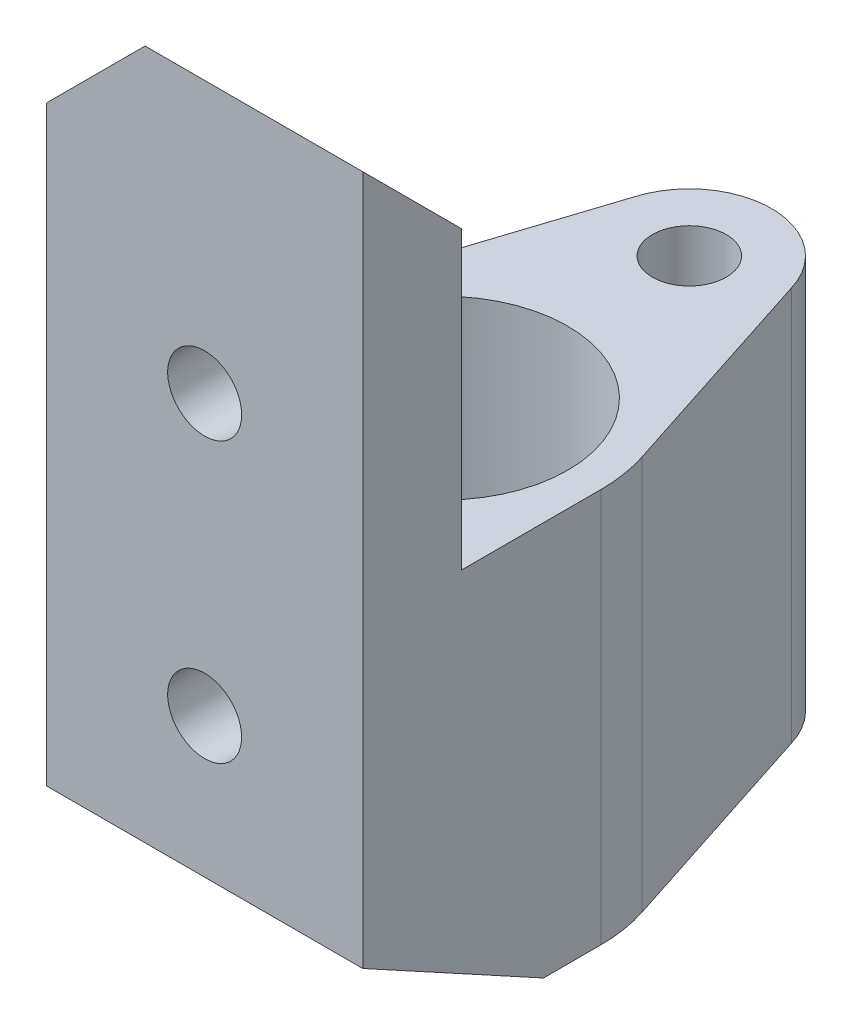
ISO-10303-21;
HEADER;
FILE_DESCRIPTION(('STEP AP214'),'2;1');
FILE_NAME('part.step','',(''),(''),'','','');
FILE_SCHEMA(('AUTOMOTIVE_DESIGN { 1 0 10303 214 1 1 1 1 }'));
ENDSEC;
DATA;
#1=APPLICATION_CONTEXT('core data for automotive mechanical design processes');
#2=APPLICATION_PROTOCOL_DEFINITION('international standard','automotive_design',2000,#1);
#3=PRODUCT_CONTEXT('',#1,'mechanical');
#4=PRODUCT('Part','Part','',(#3));
#5=PRODUCT_RELATED_PRODUCT_CATEGORY('part','',(#4));
#6=PRODUCT_DEFINITION_FORMATION('','',#4);
#7=PRODUCT_DEFINITION_CONTEXT('part definition',#1,'design');
#8=PRODUCT_DEFINITION('design','',#6,#7);
#9=PRODUCT_DEFINITION_SHAPE('','',#8);
#10=(LENGTH_UNIT() NAMED_UNIT(*) SI_UNIT(.MILLI.,.METRE.));
#11=(NAMED_UNIT(*) PLANE_ANGLE_UNIT() SI_UNIT($,.RADIAN.));
#12=(NAMED_UNIT(*) SI_UNIT($,.STERADIAN.) SOLID_ANGLE_UNIT());
#13=UNCERTAINTY_MEASURE_WITH_UNIT(LENGTH_MEASURE(1.E-05),#10,'distance_accuracy_value','');
#14=(GEOMETRIC_REPRESENTATION_CONTEXT(3) GLOBAL_UNCERTAINTY_ASSIGNED_CONTEXT((#13)) GLOBAL_UNIT_ASSIGNED_CONTEXT((#10,
#11,#12)) REPRESENTATION_CONTEXT('',''));
#15=CARTESIAN_POINT('',(0.,0.,0.));
#16=DIRECTION('',(0.,0.,1.));
#17=DIRECTION('',(1.,0.,0.));
#18=AXIS2_PLACEMENT_3D('',#15,#16,#17);
#19=CARTESIAN_POINT('',(1.76941794549634E-13,24.,0.));
#20=DIRECTION('',(0.,-1.,0.));
#21=DIRECTION('',(0.,0.,-1.));
#22=AXIS2_PLACEMENT_3D('',#19,#20,#21);
#23=PLANE('',#22);
#24=DIRECTION('',(0.,0.,-1.));
#25=VECTOR('',#24,1.);
#26=CARTESIAN_POINT('',(9.62500000000001,24.,8.5));
#27=LINE('',#26,#25);
#28=CARTESIAN_POINT('',(9.62500000000001,24.,8.5));
#29=VERTEX_POINT('',#28);
#30=CARTESIAN_POINT('',(9.62500000000001,24.,0.));
#31=VERTEX_POINT('',#30);
#32=EDGE_CURVE('E152',#29,#31,#27,.T.);
#33=ORIENTED_EDGE('',*,*,#32,.T.);
#34=CARTESIAN_POINT('',(1.76941794549634E-13,24.,0.));
#35=DIRECTION('',(0.,1.,0.));
#36=DIRECTION('',(0.,0.,-1.));
#37=AXIS2_PLACEMENT_3D('',#34,#35,#36);
#38=CIRCLE('',#37,9.62499999999983);
#39=CARTESIAN_POINT('',(9.15566286321893,24.,-2.96891605389473));
#40=VERTEX_POINT('',#39);
#41=EDGE_CURVE('E156',#31,#40,#38,.T.);
#42=ORIENTED_EDGE('',*,*,#41,.T.);
#43=DIRECTION('',(-0.308458810794258,0.,-0.951237700074693));
#44=VECTOR('',#43,1.);
#45=CARTESIAN_POINT('',(4.79671218659505,24.,-16.4112236530652));
#46=LINE('',#45,#44);
#47=CARTESIAN_POINT('',(4.79671218659505,24.,-16.4112236530652));
#48=VERTEX_POINT('',#47);
#49=EDGE_CURVE('E226',#40,#48,#46,.T.);
#50=ORIENTED_EDGE('',*,*,#49,.T.);
#51=CARTESIAN_POINT('',(0.,24.,-15.));
#52=DIRECTION('',(0.,1.,0.));
#53=DIRECTION('',(0.,0.,-1.));
#54=AXIS2_PLACEMENT_3D('',#51,#52,#53);
#55=CIRCLE('',#54,5.);
#56=CARTESIAN_POINT('',(-4.79671218659505,24.,-16.4112236530652));
#57=VERTEX_POINT('',#56);
#58=EDGE_CURVE('E228',#48,#57,#55,.T.);
#59=ORIENTED_EDGE('',*,*,#58,.T.);
#60=DIRECTION('',(-0.308458810794258,0.,0.951237700074693));
#61=VECTOR('',#60,1.);
#62=CARTESIAN_POINT('',(-4.79671218659505,24.,-16.4112236530652));
#63=LINE('',#62,#61);
#64=CARTESIAN_POINT('',(-9.15566286321892,24.,-2.96891605389473));
#65=VERTEX_POINT('',#64);
#66=EDGE_CURVE('E230',#57,#65,#63,.T.);
#67=ORIENTED_EDGE('',*,*,#66,.T.);
#68=CARTESIAN_POINT('',(1.76941794549634E-13,24.,0.));
#69=DIRECTION('',(0.,1.,0.));
#70=DIRECTION('',(0.,0.,1.));
#71=AXIS2_PLACEMENT_3D('',#68,#69,#70);
#72=CIRCLE('',#71,9.62500000000018);
#73=CARTESIAN_POINT('',(-9.625,24.,0.));
#74=VERTEX_POINT('',#73);
#75=EDGE_CURVE('E232',#65,#74,#72,.T.);
#76=ORIENTED_EDGE('',*,*,#75,.T.);
#77=DIRECTION('',(0.,0.,1.));
#78=VECTOR('',#77,1.);
#79=CARTESIAN_POINT('',(-9.625,24.,8.5));
#80=LINE('',#79,#78);
#81=CARTESIAN_POINT('',(-9.625,24.,8.5));
#82=VERTEX_POINT('',#81);
#83=EDGE_CURVE('E234',#74,#82,#80,.T.);
#84=ORIENTED_EDGE('',*,*,#83,.T.);
#85=DIRECTION('',(1.,0.,0.));
#86=VECTOR('',#85,1.);
#87=CARTESIAN_POINT('',(-9.625,24.,8.5));
#88=LINE('',#87,#86);
#89=EDGE_CURVE('E164',#82,#29,#88,.T.);
#90=ORIENTED_EDGE('',*,*,#89,.T.);
#91=EDGE_LOOP('',(#33,#42,#50,#59,#67,#76,#84,#90));
#92=FACE_BOUND('',#91,.T.);
#93=CARTESIAN_POINT('',(0.,24.,0.));
#94=DIRECTION('',(0.,1.,0.));
#95=DIRECTION('',(0.,0.,1.));
#96=AXIS2_PLACEMENT_3D('',#93,#94,#95);
#97=CIRCLE('',#96,7.6);
#98=CARTESIAN_POINT('',(0.,24.,7.6));
#99=VERTEX_POINT('',#98);
#100=EDGE_CURVE('E220',#99,#99,#97,.T.);
#101=ORIENTED_EDGE('',*,*,#100,.F.);
#102=EDGE_LOOP('',(#101));
#103=FACE_BOUND('',#102,.T.);
#104=CARTESIAN_POINT('',(0.,24.,-15.));
#105=DIRECTION('',(0.,1.,0.));
#106=DIRECTION('',(0.,0.,1.));
#107=AXIS2_PLACEMENT_3D('',#104,#105,#106);
#108=CIRCLE('',#107,2.25);
#109=CARTESIAN_POINT('',(0.,24.,-12.75));
#110=VERTEX_POINT('',#109);
#111=EDGE_CURVE('E215',#110,#110,#108,.T.);
#112=ORIENTED_EDGE('',*,*,#111,.F.);
#113=EDGE_LOOP('',(#112));
#114=FACE_BOUND('',#113,.T.);
#115=ADVANCED_FACE('F32',(#92,#103,#114),#23,.F.);
#116=CARTESIAN_POINT('',(1.76941794549634E-13,0.,0.));
#117=DIRECTION('',(0.,-1.,0.));
#118=DIRECTION('',(0.,0.,-1.));
#119=AXIS2_PLACEMENT_3D('',#116,#117,#118);
#120=PLANE('',#119);
#121=DIRECTION('',(1.,0.,0.));
#122=VECTOR('',#121,1.);
#123=CARTESIAN_POINT('',(-9.625,0.,3.50000000000002));
#124=LINE('',#123,#122);
#125=CARTESIAN_POINT('',(-9.625,0.,3.50000000000002));
#126=VERTEX_POINT('',#125);
#127=CARTESIAN_POINT('',(-6.74610999020916,0.,3.50000000000002));
#128=VERTEX_POINT('',#127);
#129=EDGE_CURVE('E125',#126,#128,#124,.T.);
#130=ORIENTED_EDGE('',*,*,#129,.F.);
#131=DIRECTION('',(0.,0.,1.));
#132=VECTOR('',#131,1.);
#133=CARTESIAN_POINT('',(-9.625,0.,8.5));
#134=LINE('',#133,#132);
#135=CARTESIAN_POINT('',(-9.625,0.,0.));
#136=VERTEX_POINT('',#135);
#137=EDGE_CURVE('E142',#136,#126,#134,.T.);
#138=ORIENTED_EDGE('',*,*,#137,.F.);
#139=CARTESIAN_POINT('',(1.76941794549634E-13,0.,0.));
#140=DIRECTION('',(0.,1.,0.));
#141=DIRECTION('',(0.,0.,1.));
#142=AXIS2_PLACEMENT_3D('',#139,#140,#141);
#143=CIRCLE('',#142,9.62500000000018);
#144=CARTESIAN_POINT('',(-9.15566286321892,0.,-2.96891605389473));
#145=VERTEX_POINT('',#144);
#146=EDGE_CURVE('E153',#145,#136,#143,.T.);
#147=ORIENTED_EDGE('',*,*,#146,.F.);
#148=DIRECTION('',(-0.308458810794258,0.,0.951237700074693));
#149=VECTOR('',#148,1.);
#150=CARTESIAN_POINT('',(-4.79671218659505,0.,-16.4112236530652));
#151=LINE('',#150,#149);
#152=CARTESIAN_POINT('',(-4.79671218659505,0.,-16.4112236530652));
#153=VERTEX_POINT('',#152);
#154=EDGE_CURVE('E158',#153,#145,#151,.T.);
#155=ORIENTED_EDGE('',*,*,#154,.F.);
#156=CARTESIAN_POINT('',(0.,0.,-15.));
#157=DIRECTION('',(0.,1.,0.));
#158=DIRECTION('',(0.,0.,-1.));
#159=AXIS2_PLACEMENT_3D('',#156,#157,#158);
#160=CIRCLE('',#159,5.);
#161=CARTESIAN_POINT('',(4.79671218659505,0.,-16.4112236530652));
#162=VERTEX_POINT('',#161);
#163=EDGE_CURVE('E242',#162,#153,#160,.T.);
#164=ORIENTED_EDGE('',*,*,#163,.F.);
#165=DIRECTION('',(-0.308458810794258,0.,-0.951237700074693));
#166=VECTOR('',#165,1.);
#167=CARTESIAN_POINT('',(4.79671218659505,0.,-16.4112236530652));
#168=LINE('',#167,#166);
#169=CARTESIAN_POINT('',(9.15566286321893,0.,-2.96891605389473));
#170=VERTEX_POINT('',#169);
#171=EDGE_CURVE('E240',#170,#162,#168,.T.);
#172=ORIENTED_EDGE('',*,*,#171,.F.);
#173=CARTESIAN_POINT('',(1.76941794549634E-13,0.,0.));
#174=DIRECTION('',(0.,1.,0.));
#175=DIRECTION('',(0.,0.,-1.));
#176=AXIS2_PLACEMENT_3D('',#173,#174,#175);
#177=CIRCLE('',#176,9.62499999999983);
#178=CARTESIAN_POINT('',(9.62500000000001,0.,0.));
#179=VERTEX_POINT('',#178);
#180=EDGE_CURVE('E238',#179,#170,#177,.T.);
#181=ORIENTED_EDGE('',*,*,#180,.F.);
#182=DIRECTION('',(0.,0.,-1.));
#183=VECTOR('',#182,1.);
#184=CARTESIAN_POINT('',(9.62500000000001,0.,8.5));
#185=LINE('',#184,#183);
#186=CARTESIAN_POINT('',(9.62500000000001,0.,3.50000000000002));
#187=VERTEX_POINT('',#186);
#188=EDGE_CURVE('E223',#187,#179,#185,.T.);
#189=ORIENTED_EDGE('',*,*,#188,.F.);
#190=CARTESIAN_POINT('',(6.74610999020916,0.,3.50000000000002));
#191=VERTEX_POINT('',#190);
#192=EDGE_CURVE('E133',#191,#187,#124,.T.);
#193=ORIENTED_EDGE('',*,*,#192,.F.);
#194=CARTESIAN_POINT('',(0.,0.,0.));
#195=DIRECTION('',(0.,1.,0.));
#196=DIRECTION('',(0.,0.,1.));
#197=AXIS2_PLACEMENT_3D('',#194,#195,#196);
#198=CIRCLE('',#197,7.6);
#199=EDGE_CURVE('E145',#191,#128,#198,.T.);
#200=ORIENTED_EDGE('',*,*,#199,.T.);
#201=EDGE_LOOP('',(#130,#138,#147,#155,#164,#172,#181,#189,#193,#200));
#202=FACE_BOUND('',#201,.T.);
#203=CARTESIAN_POINT('',(0.,0.,-15.));
#204=DIRECTION('',(0.,1.,0.));
#205=DIRECTION('',(0.,0.,1.));
#206=AXIS2_PLACEMENT_3D('',#203,#204,#205);
#207=CIRCLE('',#206,2.25);
#208=CARTESIAN_POINT('',(0.,0.,-12.75));
#209=VERTEX_POINT('',#208);
#210=EDGE_CURVE('E208',#209,#209,#207,.T.);
#211=ORIENTED_EDGE('',*,*,#210,.T.);
#212=EDGE_LOOP('',(#211));
#213=FACE_BOUND('',#212,.T.);
#214=ADVANCED_FACE('F139',(#202,#213),#120,.T.);
#215=CARTESIAN_POINT('',(9.62500000000001,24.,8.5));
#216=DIRECTION('',(-1.,0.,0.));
#217=DIRECTION('',(0.,0.,1.));
#218=AXIS2_PLACEMENT_3D('',#215,#216,#217);
#219=PLANE('',#218);
#220=DIRECTION('',(0.,-1.,0.));
#221=VECTOR('',#220,1.);
#222=CARTESIAN_POINT('',(9.625,0.,8.5));
#223=LINE('',#222,#221);
#224=CARTESIAN_POINT('',(9.625,42.,8.5));
#225=VERTEX_POINT('',#224);
#226=EDGE_CURVE('E194',#225,#29,#223,.T.);
#227=ORIENTED_EDGE('',*,*,#226,.F.);
#228=DIRECTION('',(0.,-0.707106781186548,-0.707106781186548));
#229=VECTOR('',#228,1.);
#230=CARTESIAN_POINT('',(9.62500000000001,48.,14.5));
#231=LINE('',#230,#229);
#232=CARTESIAN_POINT('',(9.625,48.,14.5));
#233=VERTEX_POINT('',#232);
#234=EDGE_CURVE('E11',#225,#233,#231,.F.);
#235=ORIENTED_EDGE('',*,*,#234,.T.);
#236=DIRECTION('',(0.,1.,0.));
#237=VECTOR('',#236,1.);
#238=CARTESIAN_POINT('',(9.625,48.,14.5));
#239=LINE('',#238,#237);
#240=CARTESIAN_POINT('',(9.625,6.,14.5));
#241=VERTEX_POINT('',#240);
#242=EDGE_CURVE('E203',#241,#233,#239,.T.);
#243=ORIENTED_EDGE('',*,*,#242,.F.);
#244=DIRECTION('',(0.,0.478852130680573,0.877895572914384));
#245=VECTOR('',#244,1.);
#246=CARTESIAN_POINT('',(9.62500000000001,6.,14.5));
#247=LINE('',#246,#245);
#248=EDGE_CURVE('E134',#187,#241,#247,.T.);
#249=ORIENTED_EDGE('',*,*,#248,.F.);
#250=ORIENTED_EDGE('',*,*,#188,.T.);
#251=DIRECTION('',(0.,-1.,0.));
#252=VECTOR('',#251,1.);
#253=CARTESIAN_POINT('',(9.62500000000001,24.,0.));
#254=LINE('',#253,#252);
#255=EDGE_CURVE('E176',#31,#179,#254,.T.);
#256=ORIENTED_EDGE('',*,*,#255,.F.);
#257=ORIENTED_EDGE('',*,*,#32,.F.);
#258=EDGE_LOOP('',(#227,#235,#243,#249,#250,#256,#257));
#259=FACE_BOUND('',#258,.T.);
#260=ADVANCED_FACE('F201',(#259),#219,.F.);
#261=CARTESIAN_POINT('',(1.76941794549634E-13,24.,0.));
#262=DIRECTION('',(0.,-1.,0.));
#263=DIRECTION('',(0.,0.,-1.));
#264=AXIS2_PLACEMENT_3D('',#261,#262,#263);
#265=CYLINDRICAL_SURFACE('',#264,9.62499999999983);
#266=ORIENTED_EDGE('',*,*,#180,.T.);
#267=DIRECTION('',(0.,-1.,0.));
#268=VECTOR('',#267,1.);
#269=CARTESIAN_POINT('',(9.15566286321893,24.,-2.96891605389473));
#270=LINE('',#269,#268);
#271=EDGE_CURVE('E173',#40,#170,#270,.T.);
#272=ORIENTED_EDGE('',*,*,#271,.F.);
#273=ORIENTED_EDGE('',*,*,#41,.F.);
#274=ORIENTED_EDGE('',*,*,#255,.T.);
#275=EDGE_LOOP('',(#266,#272,#273,#274));
#276=FACE_BOUND('',#275,.T.);
#277=ADVANCED_FACE('F267',(#276),#265,.T.);
#278=CARTESIAN_POINT('',(4.79671218659505,24.,-16.4112236530652));
#279=DIRECTION('',(-0.951237700074693,0.,0.308458810794258));
#280=DIRECTION('',(0.308458810794258,0.,0.951237700074693));
#281=AXIS2_PLACEMENT_3D('',#278,#279,#280);
#282=PLANE('',#281);
#283=ORIENTED_EDGE('',*,*,#171,.T.);
#284=DIRECTION('',(0.,-1.,0.));
#285=VECTOR('',#284,1.);
#286=CARTESIAN_POINT('',(4.79671218659505,24.,-16.4112236530652));
#287=LINE('',#286,#285);
#288=EDGE_CURVE('E170',#48,#162,#287,.T.);
#289=ORIENTED_EDGE('',*,*,#288,.F.);
#290=ORIENTED_EDGE('',*,*,#49,.F.);
#291=ORIENTED_EDGE('',*,*,#271,.T.);
#292=EDGE_LOOP('',(#283,#289,#290,#291));
#293=FACE_BOUND('',#292,.T.);
#294=ADVANCED_FACE('F264',(#293),#282,.F.);
#295=CARTESIAN_POINT('',(0.,24.,-15.));
#296=DIRECTION('',(0.,-1.,0.));
#297=DIRECTION('',(0.,0.,-1.));
#298=AXIS2_PLACEMENT_3D('',#295,#296,#297);
#299=CYLINDRICAL_SURFACE('',#298,5.);
#300=ORIENTED_EDGE('',*,*,#163,.T.);
#301=DIRECTION('',(0.,-1.,0.));
#302=VECTOR('',#301,1.);
#303=CARTESIAN_POINT('',(-4.79671218659505,24.,-16.4112236530652));
#304=LINE('',#303,#302);
#305=EDGE_CURVE('E167',#57,#153,#304,.T.);
#306=ORIENTED_EDGE('',*,*,#305,.F.);
#307=ORIENTED_EDGE('',*,*,#58,.F.);
#308=ORIENTED_EDGE('',*,*,#288,.T.);
#309=EDGE_LOOP('',(#300,#306,#307,#308));
#310=FACE_BOUND('',#309,.T.);
#311=ADVANCED_FACE('F259',(#310),#299,.T.);
#312=CARTESIAN_POINT('',(-4.79671218659505,24.,-16.4112236530652));
#313=DIRECTION('',(0.951237700074693,0.,0.308458810794258));
#314=DIRECTION('',(0.308458810794258,0.,-0.951237700074694));
#315=AXIS2_PLACEMENT_3D('',#312,#313,#314);
#316=PLANE('',#315);
#317=ORIENTED_EDGE('',*,*,#154,.T.);
#318=DIRECTION('',(0.,-1.,0.));
#319=VECTOR('',#318,1.);
#320=CARTESIAN_POINT('',(-9.15566286321892,24.,-2.96891605389473));
#321=LINE('',#320,#319);
#322=EDGE_CURVE('E163',#65,#145,#321,.T.);
#323=ORIENTED_EDGE('',*,*,#322,.F.);
#324=ORIENTED_EDGE('',*,*,#66,.F.);
#325=ORIENTED_EDGE('',*,*,#305,.T.);
#326=EDGE_LOOP('',(#317,#323,#324,#325));
#327=FACE_BOUND('',#326,.T.);
#328=ADVANCED_FACE('F246',(#327),#316,.F.);
#329=CARTESIAN_POINT('',(1.76941794549634E-13,24.,0.));
#330=DIRECTION('',(0.,-1.,0.));
#331=DIRECTION('',(0.,0.,-1.));
#332=AXIS2_PLACEMENT_3D('',#329,#330,#331);
#333=CYLINDRICAL_SURFACE('',#332,9.62500000000018);
#334=ORIENTED_EDGE('',*,*,#146,.T.);
#335=DIRECTION('',(0.,-1.,0.));
#336=VECTOR('',#335,1.);
#337=CARTESIAN_POINT('',(-9.625,24.,0.));
#338=LINE('',#337,#336);
#339=EDGE_CURVE('E151',#74,#136,#338,.T.);
#340=ORIENTED_EDGE('',*,*,#339,.F.);
#341=ORIENTED_EDGE('',*,*,#75,.F.);
#342=ORIENTED_EDGE('',*,*,#322,.T.);
#343=EDGE_LOOP('',(#334,#340,#341,#342));
#344=FACE_BOUND('',#343,.T.);
#345=ADVANCED_FACE('F252',(#344),#333,.T.);
#346=CARTESIAN_POINT('',(-9.625,24.,8.5));
#347=DIRECTION('',(1.,0.,0.));
#348=DIRECTION('',(0.,0.,-1.));
#349=AXIS2_PLACEMENT_3D('',#346,#347,#348);
#350=PLANE('',#349);
#351=DIRECTION('',(0.,1.,0.));
#352=VECTOR('',#351,1.);
#353=CARTESIAN_POINT('',(-9.625,48.,14.5));
#354=LINE('',#353,#352);
#355=CARTESIAN_POINT('',(-9.625,6.,14.5));
#356=VERTEX_POINT('',#355);
#357=CARTESIAN_POINT('',(-9.625,42.,14.5));
#358=VERTEX_POINT('',#357);
#359=EDGE_CURVE('E190',#356,#358,#354,.T.);
#360=ORIENTED_EDGE('',*,*,#359,.T.);
#361=DIRECTION('',(0.,0.,-1.));
#362=VECTOR('',#361,1.);
#363=CARTESIAN_POINT('',(-9.625,42.,8.5));
#364=LINE('',#363,#362);
#365=CARTESIAN_POINT('',(-9.625,42.,8.5));
#366=VERTEX_POINT('',#365);
#367=EDGE_CURVE('E179',#358,#366,#364,.T.);
#368=ORIENTED_EDGE('',*,*,#367,.T.);
#369=DIRECTION('',(0.,-1.,0.));
#370=VECTOR('',#369,1.);
#371=CARTESIAN_POINT('',(-9.625,48.,8.5));
#372=LINE('',#371,#370);
#373=EDGE_CURVE('E188',#366,#82,#372,.T.);
#374=ORIENTED_EDGE('',*,*,#373,.T.);
#375=ORIENTED_EDGE('',*,*,#83,.F.);
#376=ORIENTED_EDGE('',*,*,#339,.T.);
#377=ORIENTED_EDGE('',*,*,#137,.T.);
#378=DIRECTION('',(0.,0.478852130680573,0.877895572914384));
#379=VECTOR('',#378,1.);
#380=CARTESIAN_POINT('',(-9.625,6.,14.5));
#381=LINE('',#380,#379);
#382=EDGE_CURVE('E122',#126,#356,#381,.T.);
#383=ORIENTED_EDGE('',*,*,#382,.T.);
#384=EDGE_LOOP('',(#360,#368,#374,#375,#376,#377,#383));
#385=FACE_BOUND('',#384,.T.);
#386=ADVANCED_FACE('F148',(#385),#350,.F.);
#387=CARTESIAN_POINT('',(0.,24.,0.));
#388=DIRECTION('',(0.,-1.,0.));
#389=DIRECTION('',(0.,0.,-1.));
#390=AXIS2_PLACEMENT_3D('',#387,#388,#389);
#391=CYLINDRICAL_SURFACE('',#390,7.6);
#392=CARTESIAN_POINT('',(2.24999999999999,14.5043030951378,7.2593043743874));
#393=CARTESIAN_POINT('',(2.24999826209453,14.3809293168731,7.25930578883575));
#394=CARTESIAN_POINT('',(2.23981808587918,14.2575382836687,7.2624839441377));
#395=CARTESIAN_POINT('',(2.19946776414385,14.014358228876,7.27480401243922));
#396=CARTESIAN_POINT('',(2.16929053682687,13.8945704990855,7.28394803818678));
#397=CARTESIAN_POINT('',(2.09005619631209,13.6621522812933,7.30707541660892));
#398=CARTESIAN_POINT('',(2.04102987253609,13.5495104684183,7.3210508735548));
#399=CARTESIAN_POINT('',(1.92558966285567,13.3340240845882,7.35225582467136));
#400=CARTESIAN_POINT('',(1.8591733227326,13.2311808992904,7.36948577804698));
#401=CARTESIAN_POINT('',(1.70864718604006,13.0350415956917,7.40585383005298));
#402=CARTESIAN_POINT('',(1.62409524994511,12.9420921037407,7.4250317669089));
#403=CARTESIAN_POINT('',(1.44064597954416,12.771463070711,7.46279417223233));
#404=CARTESIAN_POINT('',(1.34174685113375,12.6937854422315,7.48137856612263));
#405=CARTESIAN_POINT('',(1.12995245399066,12.5544073852403,7.51631146791137));
#406=CARTESIAN_POINT('',(1.01681592040326,12.4930592878712,7.53260755638016));
#407=CARTESIAN_POINT('',(0.781268054394905,12.3903930842457,7.56066558211569));
#408=CARTESIAN_POINT('',(0.658858673594293,12.3490707767072,7.57242847031262));
#409=CARTESIAN_POINT('',(0.411865260073652,12.2887730992726,7.58981287948231));
#410=CARTESIAN_POINT('',(0.287437230453275,12.2692063139818,7.59559661603876));
#411=CARTESIAN_POINT('',(0.0369390256445344,12.2511062086136,7.60094180722574));
#412=CARTESIAN_POINT('',(-0.0891308080686112,12.2525685823873,7.60050453573464));
#413=CARTESIAN_POINT('',(-0.335188952873229,12.2760858806216,7.5935721655236));
#414=CARTESIAN_POINT('',(-0.455244597226697,12.2975005447144,7.58726542263218));
#415=CARTESIAN_POINT('',(-0.689974780111163,12.3592701042953,7.56953082791123));
#416=CARTESIAN_POINT('',(-0.80464898087786,12.3996261868904,7.5581026551107));
#417=CARTESIAN_POINT('',(-1.02689690736171,12.4985734963037,7.53114654964542));
#418=CARTESIAN_POINT('',(-1.1343742630221,12.5573682879953,7.5155731589678));
#419=CARTESIAN_POINT('',(-1.33814382731892,12.6913636628377,7.48198178515856));
#420=CARTESIAN_POINT('',(-1.43443343013742,12.7665680563717,7.46396323461785));
#421=CARTESIAN_POINT('',(-1.61691565442462,12.9345784602963,7.42661369634937));
#422=CARTESIAN_POINT('',(-1.70259282541455,13.0279397455641,7.40725883409448));
#423=CARTESIAN_POINT('',(-1.85721785157048,13.2278954872564,7.37001249550751));
#424=CARTESIAN_POINT('',(-1.92616413333492,13.3344911868442,7.35212115691251));
#425=CARTESIAN_POINT('',(-2.04588913637887,13.5592168858089,7.31971558760348));
#426=CARTESIAN_POINT('',(-2.09649636760484,13.6774432452081,7.30523365705254));
#427=CARTESIAN_POINT('',(-2.17693262916571,13.9212676946505,7.28167158888356));
#428=CARTESIAN_POINT('',(-2.20676822991809,14.0468634399902,7.27258974326024));
#429=CARTESIAN_POINT('',(-2.24386023782514,14.2969660883828,7.26122966399904));
#430=CARTESIAN_POINT('',(-2.251898379398,14.4213464594541,7.25871599775668));
#431=CARTESIAN_POINT('',(-2.2473467467138,14.6696811864062,7.26012670043285));
#432=CARTESIAN_POINT('',(-2.23475977023407,14.7936355977824,7.26405019615666));
#433=CARTESIAN_POINT('',(-2.19001058391954,15.0343707405091,7.27766251063074));
#434=CARTESIAN_POINT('',(-2.15834761340607,15.1512534373464,7.2872041564755));
#435=CARTESIAN_POINT('',(-2.07692191182096,15.3780407716987,7.31082626079416));
#436=CARTESIAN_POINT('',(-2.02715643636386,15.4879443481924,7.32490740743101));
#437=CARTESIAN_POINT('',(-1.90944286629703,15.7008443901737,7.35648175330664));
#438=CARTESIAN_POINT('',(-1.84105162552202,15.8035836963589,7.37405484084415));
#439=CARTESIAN_POINT('',(-1.68855696189454,15.9964134057552,7.41045946351145));
#440=CARTESIAN_POINT('',(-1.60444987781543,16.0865008529546,7.42929129122453));
#441=CARTESIAN_POINT('',(-1.41924301371322,16.2548671315052,7.46692606698328));
#442=CARTESIAN_POINT('',(-1.31763379380667,16.3325927949232,7.48570270910281));
#443=CARTESIAN_POINT('',(-1.10236956988198,16.4699010742629,7.52041550060583));
#444=CARTESIAN_POINT('',(-0.988715175323318,16.5294846075464,7.53635179359545));
#445=CARTESIAN_POINT('',(-0.753350097197405,16.6282431312439,7.56348958441649));
#446=CARTESIAN_POINT('',(-0.63170804483161,16.6675714548396,7.57472653083977));
#447=CARTESIAN_POINT('',(-0.383150258052989,16.7251039218,7.59135610903695));
#448=CARTESIAN_POINT('',(-0.256235999619029,16.7433139366001,7.59675036520212));
#449=CARTESIAN_POINT('',(-0.00585501547454765,16.7576558789165,7.6009906024562));
#450=CARTESIAN_POINT('',(0.117562245924136,16.7545910594335,7.60007483480457));
#451=CARTESIAN_POINT('',(0.36204782367629,16.7283837099066,7.59235664213881));
#452=CARTESIAN_POINT('',(0.483116266910554,16.7052422674864,7.5855545360091));
#453=CARTESIAN_POINT('',(0.718266685120738,16.6400308980964,7.56689345623381));
#454=CARTESIAN_POINT('',(0.832407408604697,16.5981568038188,7.55508686526994));
#455=CARTESIAN_POINT('',(1.05210378554146,16.4968435868739,7.52763893500223));
#456=CARTESIAN_POINT('',(1.1576580460838,16.4374016215346,7.51199697516396));
#457=CARTESIAN_POINT('',(1.36078401303789,16.3004758017062,7.47791497656209));
#458=CARTESIAN_POINT('',(1.45800130770583,16.2224843456341,7.45940253934387));
#459=CARTESIAN_POINT('',(1.6382375487837,16.0515934716319,7.42190469334108));
#460=CARTESIAN_POINT('',(1.72125243958292,15.9586898100319,7.40291915122484));
#461=CARTESIAN_POINT('',(1.87312472687163,15.7573996070011,7.36598258430236));
#462=CARTESIAN_POINT('',(1.941505554877,15.6486442290678,7.34807709835328));
#463=CARTESIAN_POINT('',(2.05893059799147,15.4206682971803,7.31604614890087));
#464=CARTESIAN_POINT('',(2.10798454271493,15.3014530460311,7.30191878455458));
#465=CARTESIAN_POINT('',(2.18068945273924,15.0700514835554,7.2805123149907));
#466=CARTESIAN_POINT('',(2.20661068077128,14.9586300898868,7.27263309119443));
#467=CARTESIAN_POINT('',(2.24126514625106,14.7329114042823,7.26202894940118));
#468=CARTESIAN_POINT('',(2.25000161025048,14.6186146562954,7.25930306383502));
#469=CARTESIAN_POINT('',(2.24999999999999,14.5043030951378,7.2593043743874));
#470=B_SPLINE_CURVE_WITH_KNOTS('',3,(#392,#393,#394,#395,#396,#397,#398,#399,#400,#401,#402,
#403,#404,#405,#406,#407,#408,#409,#410,#411,#412,#413,#414,#415,#416,#417,#418,#419,#420,#421,
#422,#423,#424,#425,#426,#427,#428,#429,#430,#431,#432,#433,#434,#435,#436,#437,#438,#439,#440,
#441,#442,#443,#444,#445,#446,#447,#448,#449,#450,#451,#452,#453,#454,#455,#456,#457,#458,#459,
#460,#461,#462,#463,#464,#465,#466,#467,#468,#469),.UNSPECIFIED.,.T.,.F.,(4,2,2,2,2,2,2,2,2,2,2,
2,2,2,2,2,2,2,2,2,2,2,2,2,2,2,2,2,2,2,2,2,2,2,2,2,2,2,4),(0.,0.369699828990147,
0.739530654262841,1.10875992137373,1.4780413251943,1.85763072926833,2.23726764166227,
2.62453141738956,3.0117139124536,3.38809205435131,3.76439312625094,4.12902002368644,
4.493669776268,4.86249610097821,5.23140816012888,5.61418436674442,5.99699655635374,
6.38330132011571,6.76948383357099,7.14162098380244,7.51370765816776,7.87645549021006,
8.23925833867472,8.61158811592321,8.98400474101621,9.37005778501204,9.75609130488621,
10.1391579098665,10.5221179868825,10.8906998177714,11.2592616824887,11.6240574814618,
11.9889123406975,12.365215832126,12.7416266013335,13.12887753914,13.515933275717,
13.8585417475192,14.2010858862011),.UNSPECIFIED.);
#471=CARTESIAN_POINT('',(2.24999999999999,14.5043030951378,7.2593043743874));
#472=VERTEX_POINT('',#471);
#473=EDGE_CURVE('E274',#472,#472,#470,.T.);
#474=ORIENTED_EDGE('',*,*,#473,.F.);
#475=EDGE_LOOP('',(#474));
#476=FACE_BOUND('',#475,.T.);
#477=CARTESIAN_POINT('',(0.,-1.90909090909092,0.));
#478=DIRECTION('',(0.,0.877895572914384,-0.478852130680573));
#479=DIRECTION('',(0.,-0.478852130680573,-0.877895572914384));
#480=AXIS2_PLACEMENT_3D('',#477,#478,#479);
#481=ELLIPSE('',#480,8.6570660958797,7.6);
#482=EDGE_CURVE('E213',#128,#191,#481,.T.);
#483=ORIENTED_EDGE('',*,*,#482,.F.);
#484=ORIENTED_EDGE('',*,*,#199,.F.);
#485=EDGE_LOOP('',(#483,#484));
#486=FACE_BOUND('',#485,.T.);
#487=ORIENTED_EDGE('',*,*,#100,.T.);
#488=EDGE_LOOP('',(#487));
#489=FACE_BOUND('',#488,.T.);
#490=ADVANCED_FACE('F270',(#476,#486,#489),#391,.F.);
#491=CARTESIAN_POINT('',(0.,24.,-15.));
#492=DIRECTION('',(0.,-1.,0.));
#493=DIRECTION('',(0.,0.,-1.));
#494=AXIS2_PLACEMENT_3D('',#491,#492,#493);
#495=CYLINDRICAL_SURFACE('',#494,2.25);
#496=ORIENTED_EDGE('',*,*,#111,.T.);
#497=EDGE_LOOP('',(#496));
#498=FACE_BOUND('',#497,.T.);
#499=ORIENTED_EDGE('',*,*,#210,.F.);
#500=EDGE_LOOP('',(#499));
#501=FACE_BOUND('',#500,.T.);
#502=ADVANCED_FACE('F298',(#498,#501),#495,.F.);
#503=CARTESIAN_POINT('',(9.625,48.,8.5));
#504=DIRECTION('',(0.,0.,-1.));
#505=DIRECTION('',(-1.,0.,0.));
#506=AXIS2_PLACEMENT_3D('',#503,#504,#505);
#507=PLANE('',#506);
#508=CARTESIAN_POINT('',(0.,31.5,8.5));
#509=DIRECTION('',(0.,0.,-1.));
#510=DIRECTION('',(-1.,0.,0.));
#511=AXIS2_PLACEMENT_3D('',#508,#509,#510);
#512=CIRCLE('',#511,2.25);
#513=CARTESIAN_POINT('',(-2.25000000000001,31.5,8.5));
#514=VERTEX_POINT('',#513);
#515=EDGE_CURVE('E451',#514,#514,#512,.T.);
#516=ORIENTED_EDGE('',*,*,#515,.F.);
#517=EDGE_LOOP('',(#516));
#518=FACE_BOUND('',#517,.T.);
#519=ORIENTED_EDGE('',*,*,#373,.F.);
#520=DIRECTION('',(1.,0.,0.));
#521=VECTOR('',#520,1.);
#522=CARTESIAN_POINT('',(9.625,42.,8.5));
#523=LINE('',#522,#521);
#524=EDGE_CURVE('E40',#366,#225,#523,.T.);
#525=ORIENTED_EDGE('',*,*,#524,.T.);
#526=ORIENTED_EDGE('',*,*,#226,.T.);
#527=ORIENTED_EDGE('',*,*,#89,.F.);
#528=EDGE_LOOP('',(#519,#525,#526,#527));
#529=FACE_BOUND('',#528,.T.);
#530=ADVANCED_FACE('F191',(#518,#529),#507,.T.);
#531=CARTESIAN_POINT('',(9.625,48.,14.5));
#532=DIRECTION('',(0.,0.,1.));
#533=DIRECTION('',(0.,-1.,0.));
#534=AXIS2_PLACEMENT_3D('',#531,#532,#533);
#535=PLANE('',#534);
#536=CARTESIAN_POINT('',(0.,31.5,14.5));
#537=DIRECTION('',(0.,0.,1.));
#538=DIRECTION('',(1.,0.,0.));
#539=AXIS2_PLACEMENT_3D('',#536,#537,#538);
#540=CIRCLE('',#539,2.25);
#541=CARTESIAN_POINT('',(2.24999999999999,31.5,14.5));
#542=VERTEX_POINT('',#541);
#543=EDGE_CURVE('E454',#542,#542,#540,.T.);
#544=ORIENTED_EDGE('',*,*,#543,.F.);
#545=EDGE_LOOP('',(#544));
#546=FACE_BOUND('',#545,.T.);
#547=CARTESIAN_POINT('',(0.,14.5043030951378,14.5));
#548=DIRECTION('',(0.,0.,1.));
#549=DIRECTION('',(1.,0.,0.));
#550=AXIS2_PLACEMENT_3D('',#547,#548,#549);
#551=CIRCLE('',#550,2.25);
#552=CARTESIAN_POINT('',(2.24999999999999,14.5043030951378,14.5));
#553=VERTEX_POINT('',#552);
#554=EDGE_CURVE('E282',#553,#553,#551,.T.);
#555=ORIENTED_EDGE('',*,*,#554,.F.);
#556=EDGE_LOOP('',(#555));
#557=FACE_BOUND('',#556,.T.);
#558=DIRECTION('',(-1.,0.,0.));
#559=VECTOR('',#558,1.);
#560=CARTESIAN_POINT('',(9.625,48.,14.5));
#561=LINE('',#560,#559);
#562=CARTESIAN_POINT('',(-3.62499999999998,48.,14.5));
#563=VERTEX_POINT('',#562);
#564=EDGE_CURVE('E197',#233,#563,#561,.T.);
#565=ORIENTED_EDGE('',*,*,#564,.T.);
#566=DIRECTION('',(-0.707106781186548,-0.707106781186548,0.));
#567=VECTOR('',#566,1.);
#568=CARTESIAN_POINT('',(3.00000000000001,54.625,14.5));
#569=LINE('',#568,#567);
#570=EDGE_CURVE('E182',#563,#358,#569,.T.);
#571=ORIENTED_EDGE('',*,*,#570,.T.);
#572=ORIENTED_EDGE('',*,*,#359,.F.);
#573=DIRECTION('',(1.,0.,0.));
#574=VECTOR('',#573,1.);
#575=CARTESIAN_POINT('',(-9.625,6.,14.5));
#576=LINE('',#575,#574);
#577=EDGE_CURVE('E128',#356,#241,#576,.T.);
#578=ORIENTED_EDGE('',*,*,#577,.T.);
#579=ORIENTED_EDGE('',*,*,#242,.T.);
#580=EDGE_LOOP('',(#565,#571,#572,#578,#579));
#581=FACE_BOUND('',#580,.T.);
#582=ADVANCED_FACE('F206',(#546,#557,#581),#535,.T.);
#583=CARTESIAN_POINT('',(-9.625,6.,14.5));
#584=DIRECTION('',(0.,0.877895572914384,-0.478852130680573));
#585=DIRECTION('',(0.,0.478852130680573,0.877895572914384));
#586=AXIS2_PLACEMENT_3D('',#583,#584,#585);
#587=PLANE('',#586);
#588=ORIENTED_EDGE('',*,*,#482,.T.);
#589=ORIENTED_EDGE('',*,*,#192,.T.);
#590=ORIENTED_EDGE('',*,*,#248,.T.);
#591=ORIENTED_EDGE('',*,*,#577,.F.);
#592=ORIENTED_EDGE('',*,*,#382,.F.);
#593=ORIENTED_EDGE('',*,*,#129,.T.);
#594=EDGE_LOOP('',(#588,#589,#590,#591,#592,#593));
#595=FACE_BOUND('',#594,.T.);
#596=ADVANCED_FACE('F124',(#595),#587,.F.);
#597=CARTESIAN_POINT('',(-9.625,42.,8.5));
#598=DIRECTION('',(-0.707106781186547,0.707106781186547,0.));
#599=DIRECTION('',(0.,0.,1.));
#600=AXIS2_PLACEMENT_3D('',#597,#598,#599);
#601=PLANE('',#600);
#602=ORIENTED_EDGE('',*,*,#570,.F.);
#603=DIRECTION('',(0.577350269189626,0.577350269189626,0.577350269189626));
#604=VECTOR('',#603,1.);
#605=CARTESIAN_POINT('',(-9.625,42.,8.5));
#606=LINE('',#605,#604);
#607=EDGE_CURVE('E53',#563,#366,#606,.F.);
#608=ORIENTED_EDGE('',*,*,#607,.T.);
#609=ORIENTED_EDGE('',*,*,#367,.F.);
#610=EDGE_LOOP('',(#602,#608,#609));
#611=FACE_BOUND('',#610,.T.);
#612=ADVANCED_FACE('F187',(#611),#601,.T.);
#613=CARTESIAN_POINT('',(0.,14.5043030951378,-1.49999999999998));
#614=DIRECTION('',(0.,0.,1.));
#615=DIRECTION('',(1.,0.,0.));
#616=AXIS2_PLACEMENT_3D('',#613,#614,#615);
#617=CYLINDRICAL_SURFACE('',#616,2.25);
#618=ORIENTED_EDGE('',*,*,#473,.T.);
#619=EDGE_LOOP('',(#618));
#620=FACE_BOUND('',#619,.T.);
#621=ORIENTED_EDGE('',*,*,#554,.T.);
#622=EDGE_LOOP('',(#621));
#623=FACE_BOUND('',#622,.T.);
#624=ADVANCED_FACE('F287',(#620,#623),#617,.F.);
#625=CARTESIAN_POINT('',(0.,31.5,-1.49999999999998));
#626=DIRECTION('',(0.,0.,1.));
#627=DIRECTION('',(1.,0.,0.));
#628=AXIS2_PLACEMENT_3D('',#625,#626,#627);
#629=CYLINDRICAL_SURFACE('',#628,2.25);
#630=ORIENTED_EDGE('',*,*,#515,.T.);
#631=EDGE_LOOP('',(#630));
#632=FACE_BOUND('',#631,.T.);
#633=ORIENTED_EDGE('',*,*,#543,.T.);
#634=EDGE_LOOP('',(#633));
#635=FACE_BOUND('',#634,.T.);
#636=ADVANCED_FACE('F292',(#632,#635),#629,.F.);
#637=CARTESIAN_POINT('',(9.625,48.,14.5));
#638=DIRECTION('',(0.,-0.707106781186547,0.707106781186547));
#639=DIRECTION('',(-1.,0.,0.));
#640=AXIS2_PLACEMENT_3D('',#637,#638,#639);
#641=PLANE('',#640);
#642=ORIENTED_EDGE('',*,*,#234,.F.);
#643=ORIENTED_EDGE('',*,*,#524,.F.);
#644=ORIENTED_EDGE('',*,*,#607,.F.);
#645=ORIENTED_EDGE('',*,*,#564,.F.);
#646=EDGE_LOOP('',(#642,#643,#644,#645));
#647=FACE_BOUND('',#646,.T.);
#648=ADVANCED_FACE('F34',(#647),#641,.F.);
#649=CLOSED_SHELL('',(#115,#214,#260,#277,#294,#311,#328,#345,#386,#490,#502,#530,#582,#596,
#612,#624,#636,#648));
#650=MANIFOLD_SOLID_BREP('B2',#649);
#651=ADVANCED_BREP_SHAPE_REPRESENTATION('',(#18,#650),#14);
#652=SHAPE_DEFINITION_REPRESENTATION(#9,#651);
ENDSEC;
END-ISO-10303-21;
